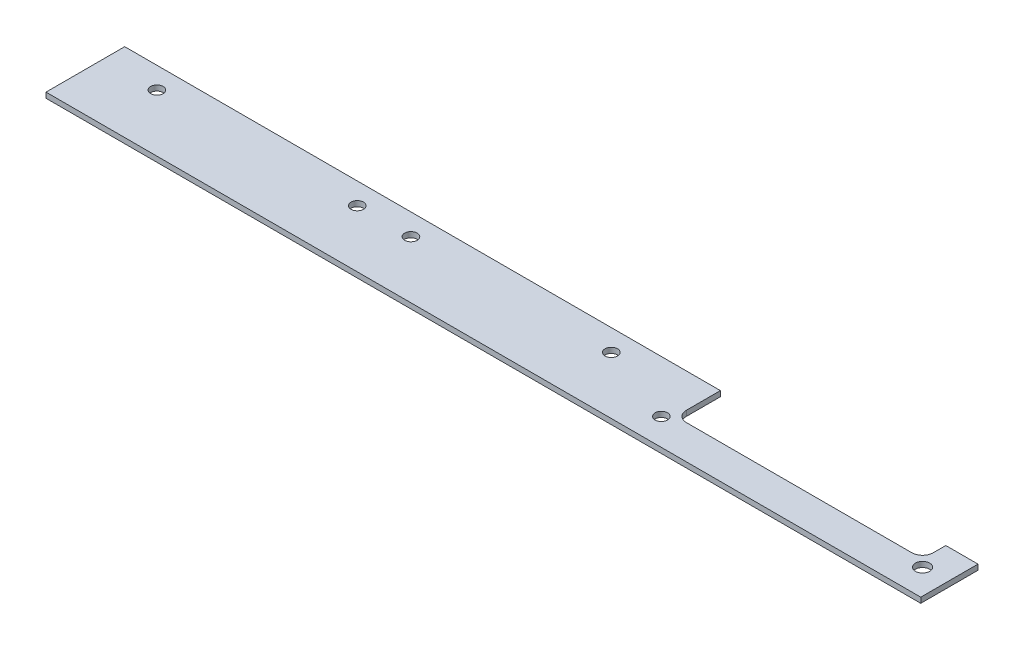
ISO-10303-21;
HEADER;
FILE_DESCRIPTION(('STEP AP214'),'2;1');
FILE_NAME('part.step','',(''),(''),'','','');
FILE_SCHEMA(('AUTOMOTIVE_DESIGN { 1 0 10303 214 1 1 1 1 }'));
ENDSEC;
DATA;
#1=APPLICATION_CONTEXT('core data for automotive mechanical design processes');
#2=APPLICATION_PROTOCOL_DEFINITION('international standard','automotive_design',2000,#1);
#3=PRODUCT_CONTEXT('',#1,'mechanical');
#4=PRODUCT('Part','Part','',(#3));
#5=PRODUCT_RELATED_PRODUCT_CATEGORY('part','',(#4));
#6=PRODUCT_DEFINITION_FORMATION('','',#4);
#7=PRODUCT_DEFINITION_CONTEXT('part definition',#1,'design');
#8=PRODUCT_DEFINITION('design','',#6,#7);
#9=PRODUCT_DEFINITION_SHAPE('','',#8);
#10=(LENGTH_UNIT() NAMED_UNIT(*) SI_UNIT(.MILLI.,.METRE.));
#11=(NAMED_UNIT(*) PLANE_ANGLE_UNIT() SI_UNIT($,.RADIAN.));
#12=(NAMED_UNIT(*) SI_UNIT($,.STERADIAN.) SOLID_ANGLE_UNIT());
#13=UNCERTAINTY_MEASURE_WITH_UNIT(LENGTH_MEASURE(1.E-05),#10,'distance_accuracy_value','');
#14=(GEOMETRIC_REPRESENTATION_CONTEXT(3) GLOBAL_UNCERTAINTY_ASSIGNED_CONTEXT((#13)) GLOBAL_UNIT_ASSIGNED_CONTEXT((#10,
#11,#12)) REPRESENTATION_CONTEXT('',''));
#15=CARTESIAN_POINT('',(0.,0.,0.));
#16=DIRECTION('',(0.,0.,1.));
#17=DIRECTION('',(1.,0.,0.));
#18=AXIS2_PLACEMENT_3D('',#15,#16,#17);
#19=CARTESIAN_POINT('',(169.5,1.5,-12.5));
#20=DIRECTION('',(0.,1.,0.));
#21=DIRECTION('',(0.,0.,1.));
#22=AXIS2_PLACEMENT_3D('',#19,#20,#21);
#23=PLANE('',#22);
#24=CARTESIAN_POINT('',(142.,1.5,-16.));
#25=DIRECTION('',(0.,1.,0.));
#26=DIRECTION('',(0.,0.,1.));
#27=AXIS2_PLACEMENT_3D('',#24,#25,#26);
#28=CIRCLE('',#27,1.74999999999998);
#29=CARTESIAN_POINT('',(142.,1.5,-14.25));
#30=VERTEX_POINT('',#29);
#31=EDGE_CURVE('E232',#30,#30,#28,.T.);
#32=ORIENTED_EDGE('',*,*,#31,.F.);
#33=EDGE_LOOP('',(#32));
#34=FACE_BOUND('',#33,.T.);
#35=CARTESIAN_POINT('',(164.5,1.5,-7.5));
#36=DIRECTION('',(0.,1.,0.));
#37=DIRECTION('',(0.,0.,1.));
#38=AXIS2_PLACEMENT_3D('',#35,#36,#37);
#39=CIRCLE('',#38,1.75000000000001);
#40=CARTESIAN_POINT('',(164.5,1.5,-5.74999999999999));
#41=VERTEX_POINT('',#40);
#42=EDGE_CURVE('E220',#41,#41,#39,.T.);
#43=ORIENTED_EDGE('',*,*,#42,.F.);
#44=EDGE_LOOP('',(#43));
#45=FACE_BOUND('',#44,.T.);
#46=CARTESIAN_POINT('',(15.,1.5,-16.));
#47=DIRECTION('',(0.,1.,0.));
#48=DIRECTION('',(0.,0.,1.));
#49=AXIS2_PLACEMENT_3D('',#46,#47,#48);
#50=CIRCLE('',#49,1.75);
#51=CARTESIAN_POINT('',(15.,1.5,-14.25));
#52=VERTEX_POINT('',#51);
#53=EDGE_CURVE('E148',#52,#52,#50,.T.);
#54=ORIENTED_EDGE('',*,*,#53,.F.);
#55=EDGE_LOOP('',(#54));
#56=FACE_BOUND('',#55,.T.);
#57=DIRECTION('',(0.,0.,1.));
#58=VECTOR('',#57,1.);
#59=CARTESIAN_POINT('',(0.,1.5,0.));
#60=LINE('',#59,#58);
#61=CARTESIAN_POINT('',(0.,1.5,-22.));
#62=VERTEX_POINT('',#61);
#63=CARTESIAN_POINT('',(0.,1.5,0.));
#64=VERTEX_POINT('',#63);
#65=EDGE_CURVE('E163',#62,#64,#60,.T.);
#66=ORIENTED_EDGE('',*,*,#65,.T.);
#67=DIRECTION('',(1.,0.,0.));
#68=VECTOR('',#67,1.);
#69=CARTESIAN_POINT('',(0.,1.5,0.));
#70=LINE('',#69,#68);
#71=CARTESIAN_POINT('',(244.5,1.5,0.));
#72=VERTEX_POINT('',#71);
#73=EDGE_CURVE('E101',#64,#72,#70,.T.);
#74=ORIENTED_EDGE('',*,*,#73,.T.);
#75=DIRECTION('',(0.,0.,-1.));
#76=VECTOR('',#75,1.);
#77=CARTESIAN_POINT('',(244.5,1.5,-16.));
#78=LINE('',#77,#76);
#79=CARTESIAN_POINT('',(244.5,1.5,-16.));
#80=VERTEX_POINT('',#79);
#81=EDGE_CURVE('E184',#72,#80,#78,.T.);
#82=ORIENTED_EDGE('',*,*,#81,.T.);
#83=DIRECTION('',(-1.,0.,0.));
#84=VECTOR('',#83,1.);
#85=CARTESIAN_POINT('',(235.5,1.5,-16.));
#86=LINE('',#85,#84);
#87=CARTESIAN_POINT('',(235.5,1.5,-16.));
#88=VERTEX_POINT('',#87);
#89=EDGE_CURVE('E203',#80,#88,#86,.T.);
#90=ORIENTED_EDGE('',*,*,#89,.T.);
#91=DIRECTION('',(0.,0.,1.));
#92=VECTOR('',#91,1.);
#93=CARTESIAN_POINT('',(235.5,1.5,-12.5));
#94=LINE('',#93,#92);
#95=CARTESIAN_POINT('',(235.5,1.5,-12.5));
#96=VERTEX_POINT('',#95);
#97=EDGE_CURVE('E200',#88,#96,#94,.T.);
#98=ORIENTED_EDGE('',*,*,#97,.T.);
#99=CARTESIAN_POINT('',(232.5,1.5,-12.5));
#100=DIRECTION('',(0.,-1.,0.));
#101=DIRECTION('',(0.,0.,1.));
#102=AXIS2_PLACEMENT_3D('',#99,#100,#101);
#103=CIRCLE('',#102,3.);
#104=CARTESIAN_POINT('',(232.5,1.5,-9.5));
#105=VERTEX_POINT('',#104);
#106=EDGE_CURVE('E202',#96,#105,#103,.T.);
#107=ORIENTED_EDGE('',*,*,#106,.T.);
#108=DIRECTION('',(-1.,0.,0.));
#109=VECTOR('',#108,1.);
#110=CARTESIAN_POINT('',(169.5,1.5,-9.5));
#111=LINE('',#110,#109);
#112=CARTESIAN_POINT('',(169.5,1.5,-9.5));
#113=VERTEX_POINT('',#112);
#114=EDGE_CURVE('E126',#105,#113,#111,.T.);
#115=ORIENTED_EDGE('',*,*,#114,.T.);
#116=CARTESIAN_POINT('',(169.5,1.5,-12.5));
#117=DIRECTION('',(0.,-1.,0.));
#118=DIRECTION('',(0.,0.,1.));
#119=AXIS2_PLACEMENT_3D('',#116,#117,#118);
#120=CIRCLE('',#119,3.);
#121=CARTESIAN_POINT('',(166.5,1.5,-12.5));
#122=VERTEX_POINT('',#121);
#123=EDGE_CURVE('E120',#113,#122,#120,.T.);
#124=ORIENTED_EDGE('',*,*,#123,.T.);
#125=DIRECTION('',(0.,0.,-1.));
#126=VECTOR('',#125,1.);
#127=CARTESIAN_POINT('',(166.5,1.5,-22.));
#128=LINE('',#127,#126);
#129=CARTESIAN_POINT('',(166.5,1.5,-22.));
#130=VERTEX_POINT('',#129);
#131=EDGE_CURVE('E124',#122,#130,#128,.T.);
#132=ORIENTED_EDGE('',*,*,#131,.T.);
#133=DIRECTION('',(-1.,0.,0.));
#134=VECTOR('',#133,1.);
#135=CARTESIAN_POINT('',(0.,1.5,-22.));
#136=LINE('',#135,#134);
#137=EDGE_CURVE('E52',#130,#62,#136,.T.);
#138=ORIENTED_EDGE('',*,*,#137,.T.);
#139=EDGE_LOOP('',(#66,#74,#82,#90,#98,#107,#115,#124,#132,#138));
#140=FACE_BOUND('',#139,.T.);
#141=CARTESIAN_POINT('',(71.,1.5,-16.));
#142=DIRECTION('',(0.,1.,0.));
#143=DIRECTION('',(0.,0.,1.));
#144=AXIS2_PLACEMENT_3D('',#141,#142,#143);
#145=CIRCLE('',#144,1.75);
#146=CARTESIAN_POINT('',(71.,1.5,-14.25));
#147=VERTEX_POINT('',#146);
#148=EDGE_CURVE('E214',#147,#147,#145,.T.);
#149=ORIENTED_EDGE('',*,*,#148,.F.);
#150=EDGE_LOOP('',(#149));
#151=FACE_BOUND('',#150,.T.);
#152=CARTESIAN_POINT('',(86.,1.5,-16.));
#153=DIRECTION('',(0.,1.,0.));
#154=DIRECTION('',(0.,0.,1.));
#155=AXIS2_PLACEMENT_3D('',#152,#153,#154);
#156=CIRCLE('',#155,1.75);
#157=CARTESIAN_POINT('',(86.,1.5,-14.25));
#158=VERTEX_POINT('',#157);
#159=EDGE_CURVE('E226',#158,#158,#156,.T.);
#160=ORIENTED_EDGE('',*,*,#159,.F.);
#161=EDGE_LOOP('',(#160));
#162=FACE_BOUND('',#161,.T.);
#163=CARTESIAN_POINT('',(237.5,1.5,-7.5));
#164=DIRECTION('',(0.,1.,0.));
#165=DIRECTION('',(0.,0.,1.));
#166=AXIS2_PLACEMENT_3D('',#163,#164,#165);
#167=CIRCLE('',#166,2.);
#168=CARTESIAN_POINT('',(237.5,1.5,-5.5));
#169=VERTEX_POINT('',#168);
#170=EDGE_CURVE('E238',#169,#169,#167,.T.);
#171=ORIENTED_EDGE('',*,*,#170,.F.);
#172=EDGE_LOOP('',(#171));
#173=FACE_BOUND('',#172,.T.);
#174=ADVANCED_FACE('F35',(#34,#45,#56,#140,#151,#162,#173),#23,.T.);
#175=CARTESIAN_POINT('',(169.5,0.,-12.5));
#176=DIRECTION('',(0.,1.,0.));
#177=DIRECTION('',(0.,0.,1.));
#178=AXIS2_PLACEMENT_3D('',#175,#176,#177);
#179=PLANE('',#178);
#180=DIRECTION('',(0.,0.,1.));
#181=VECTOR('',#180,1.);
#182=CARTESIAN_POINT('',(0.,0.,0.));
#183=LINE('',#182,#181);
#184=CARTESIAN_POINT('',(0.,0.,-22.));
#185=VERTEX_POINT('',#184);
#186=CARTESIAN_POINT('',(0.,0.,0.));
#187=VERTEX_POINT('',#186);
#188=EDGE_CURVE('E144',#185,#187,#183,.T.);
#189=ORIENTED_EDGE('',*,*,#188,.F.);
#190=DIRECTION('',(-1.,0.,0.));
#191=VECTOR('',#190,1.);
#192=CARTESIAN_POINT('',(0.,0.,-22.));
#193=LINE('',#192,#191);
#194=CARTESIAN_POINT('',(166.5,0.,-22.));
#195=VERTEX_POINT('',#194);
#196=EDGE_CURVE('E93',#195,#185,#193,.T.);
#197=ORIENTED_EDGE('',*,*,#196,.F.);
#198=DIRECTION('',(0.,0.,-1.));
#199=VECTOR('',#198,1.);
#200=CARTESIAN_POINT('',(166.5,0.,-22.));
#201=LINE('',#200,#199);
#202=CARTESIAN_POINT('',(166.5,0.,-12.5));
#203=VERTEX_POINT('',#202);
#204=EDGE_CURVE('E87',#203,#195,#201,.T.);
#205=ORIENTED_EDGE('',*,*,#204,.F.);
#206=CARTESIAN_POINT('',(169.5,0.,-12.5));
#207=DIRECTION('',(0.,-1.,0.));
#208=DIRECTION('',(0.,0.,1.));
#209=AXIS2_PLACEMENT_3D('',#206,#207,#208);
#210=CIRCLE('',#209,3.);
#211=CARTESIAN_POINT('',(169.5,0.,-9.5));
#212=VERTEX_POINT('',#211);
#213=EDGE_CURVE('E134',#212,#203,#210,.T.);
#214=ORIENTED_EDGE('',*,*,#213,.F.);
#215=DIRECTION('',(-1.,0.,0.));
#216=VECTOR('',#215,1.);
#217=CARTESIAN_POINT('',(169.5,0.,-9.5));
#218=LINE('',#217,#216);
#219=CARTESIAN_POINT('',(232.5,0.,-9.5));
#220=VERTEX_POINT('',#219);
#221=EDGE_CURVE('E158',#220,#212,#218,.T.);
#222=ORIENTED_EDGE('',*,*,#221,.F.);
#223=CARTESIAN_POINT('',(232.5,0.,-12.5));
#224=DIRECTION('',(0.,-1.,0.));
#225=DIRECTION('',(0.,0.,1.));
#226=AXIS2_PLACEMENT_3D('',#223,#224,#225);
#227=CIRCLE('',#226,3.);
#228=CARTESIAN_POINT('',(235.5,0.,-12.5));
#229=VERTEX_POINT('',#228);
#230=EDGE_CURVE('E156',#229,#220,#227,.T.);
#231=ORIENTED_EDGE('',*,*,#230,.F.);
#232=DIRECTION('',(0.,0.,1.));
#233=VECTOR('',#232,1.);
#234=CARTESIAN_POINT('',(235.5,0.,-12.5));
#235=LINE('',#234,#233);
#236=CARTESIAN_POINT('',(235.5,0.,-16.));
#237=VERTEX_POINT('',#236);
#238=EDGE_CURVE('E154',#237,#229,#235,.T.);
#239=ORIENTED_EDGE('',*,*,#238,.F.);
#240=DIRECTION('',(-1.,0.,0.));
#241=VECTOR('',#240,1.);
#242=CARTESIAN_POINT('',(235.5,0.,-16.));
#243=LINE('',#242,#241);
#244=CARTESIAN_POINT('',(244.5,0.,-16.));
#245=VERTEX_POINT('',#244);
#246=EDGE_CURVE('E152',#245,#237,#243,.T.);
#247=ORIENTED_EDGE('',*,*,#246,.F.);
#248=DIRECTION('',(0.,0.,-1.));
#249=VECTOR('',#248,1.);
#250=CARTESIAN_POINT('',(244.5,0.,-16.));
#251=LINE('',#250,#249);
#252=CARTESIAN_POINT('',(244.5,0.,0.));
#253=VERTEX_POINT('',#252);
#254=EDGE_CURVE('E150',#253,#245,#251,.T.);
#255=ORIENTED_EDGE('',*,*,#254,.F.);
#256=DIRECTION('',(1.,0.,0.));
#257=VECTOR('',#256,1.);
#258=CARTESIAN_POINT('',(0.,0.,0.));
#259=LINE('',#258,#257);
#260=EDGE_CURVE('E147',#187,#253,#259,.T.);
#261=ORIENTED_EDGE('',*,*,#260,.F.);
#262=EDGE_LOOP('',(#189,#197,#205,#214,#222,#231,#239,#247,#255,#261));
#263=FACE_BOUND('',#262,.T.);
#264=CARTESIAN_POINT('',(15.,0.,-16.));
#265=DIRECTION('',(0.,1.,0.));
#266=DIRECTION('',(0.,0.,1.));
#267=AXIS2_PLACEMENT_3D('',#264,#265,#266);
#268=CIRCLE('',#267,1.75);
#269=CARTESIAN_POINT('',(15.,0.,-14.25));
#270=VERTEX_POINT('',#269);
#271=EDGE_CURVE('E211',#270,#270,#268,.T.);
#272=ORIENTED_EDGE('',*,*,#271,.T.);
#273=EDGE_LOOP('',(#272));
#274=FACE_BOUND('',#273,.T.);
#275=CARTESIAN_POINT('',(71.,0.,-16.));
#276=DIRECTION('',(0.,1.,0.));
#277=DIRECTION('',(0.,0.,1.));
#278=AXIS2_PLACEMENT_3D('',#275,#276,#277);
#279=CIRCLE('',#278,1.75);
#280=CARTESIAN_POINT('',(71.,0.,-14.25));
#281=VERTEX_POINT('',#280);
#282=EDGE_CURVE('E217',#281,#281,#279,.T.);
#283=ORIENTED_EDGE('',*,*,#282,.T.);
#284=EDGE_LOOP('',(#283));
#285=FACE_BOUND('',#284,.T.);
#286=CARTESIAN_POINT('',(164.5,0.,-7.5));
#287=DIRECTION('',(0.,1.,0.));
#288=DIRECTION('',(0.,0.,1.));
#289=AXIS2_PLACEMENT_3D('',#286,#287,#288);
#290=CIRCLE('',#289,1.75000000000001);
#291=CARTESIAN_POINT('',(164.5,0.,-5.74999999999999));
#292=VERTEX_POINT('',#291);
#293=EDGE_CURVE('E223',#292,#292,#290,.T.);
#294=ORIENTED_EDGE('',*,*,#293,.T.);
#295=EDGE_LOOP('',(#294));
#296=FACE_BOUND('',#295,.T.);
#297=CARTESIAN_POINT('',(86.,0.,-16.));
#298=DIRECTION('',(0.,1.,0.));
#299=DIRECTION('',(0.,0.,1.));
#300=AXIS2_PLACEMENT_3D('',#297,#298,#299);
#301=CIRCLE('',#300,1.75);
#302=CARTESIAN_POINT('',(86.,0.,-14.25));
#303=VERTEX_POINT('',#302);
#304=EDGE_CURVE('E229',#303,#303,#301,.T.);
#305=ORIENTED_EDGE('',*,*,#304,.T.);
#306=EDGE_LOOP('',(#305));
#307=FACE_BOUND('',#306,.T.);
#308=CARTESIAN_POINT('',(142.,0.,-16.));
#309=DIRECTION('',(0.,1.,0.));
#310=DIRECTION('',(0.,0.,1.));
#311=AXIS2_PLACEMENT_3D('',#308,#309,#310);
#312=CIRCLE('',#311,1.74999999999998);
#313=CARTESIAN_POINT('',(142.,0.,-14.25));
#314=VERTEX_POINT('',#313);
#315=EDGE_CURVE('E235',#314,#314,#312,.T.);
#316=ORIENTED_EDGE('',*,*,#315,.T.);
#317=EDGE_LOOP('',(#316));
#318=FACE_BOUND('',#317,.T.);
#319=CARTESIAN_POINT('',(237.5,0.,-7.5));
#320=DIRECTION('',(0.,1.,0.));
#321=DIRECTION('',(0.,0.,1.));
#322=AXIS2_PLACEMENT_3D('',#319,#320,#321);
#323=CIRCLE('',#322,2.);
#324=CARTESIAN_POINT('',(237.5,0.,-5.5));
#325=VERTEX_POINT('',#324);
#326=EDGE_CURVE('E241',#325,#325,#323,.T.);
#327=ORIENTED_EDGE('',*,*,#326,.T.);
#328=EDGE_LOOP('',(#327));
#329=FACE_BOUND('',#328,.T.);
#330=ADVANCED_FACE('F188',(#263,#274,#285,#296,#307,#318,#329),#179,.F.);
#331=CARTESIAN_POINT('',(0.,1.5,0.));
#332=DIRECTION('',(1.,0.,0.));
#333=DIRECTION('',(0.,0.,-1.));
#334=AXIS2_PLACEMENT_3D('',#331,#332,#333);
#335=PLANE('',#334);
#336=ORIENTED_EDGE('',*,*,#188,.T.);
#337=DIRECTION('',(0.,-1.,0.));
#338=VECTOR('',#337,1.);
#339=CARTESIAN_POINT('',(0.,1.5,0.));
#340=LINE('',#339,#338);
#341=EDGE_CURVE('E11',#64,#187,#340,.T.);
#342=ORIENTED_EDGE('',*,*,#341,.F.);
#343=ORIENTED_EDGE('',*,*,#65,.F.);
#344=DIRECTION('',(0.,-1.,0.));
#345=VECTOR('',#344,1.);
#346=CARTESIAN_POINT('',(0.,1.5,-22.));
#347=LINE('',#346,#345);
#348=EDGE_CURVE('E140',#62,#185,#347,.T.);
#349=ORIENTED_EDGE('',*,*,#348,.T.);
#350=EDGE_LOOP('',(#336,#342,#343,#349));
#351=FACE_BOUND('',#350,.T.);
#352=ADVANCED_FACE('F37',(#351),#335,.F.);
#353=CARTESIAN_POINT('',(0.,1.5,0.));
#354=DIRECTION('',(0.,0.,-1.));
#355=DIRECTION('',(-1.,0.,0.));
#356=AXIS2_PLACEMENT_3D('',#353,#354,#355);
#357=PLANE('',#356);
#358=ORIENTED_EDGE('',*,*,#260,.T.);
#359=DIRECTION('',(0.,-1.,0.));
#360=VECTOR('',#359,1.);
#361=CARTESIAN_POINT('',(244.5,1.5,0.));
#362=LINE('',#361,#360);
#363=EDGE_CURVE('E44',#72,#253,#362,.T.);
#364=ORIENTED_EDGE('',*,*,#363,.F.);
#365=ORIENTED_EDGE('',*,*,#73,.F.);
#366=ORIENTED_EDGE('',*,*,#341,.T.);
#367=EDGE_LOOP('',(#358,#364,#365,#366));
#368=FACE_BOUND('',#367,.T.);
#369=ADVANCED_FACE('F283',(#368),#357,.F.);
#370=CARTESIAN_POINT('',(244.5,1.5,-16.));
#371=DIRECTION('',(-1.,0.,0.));
#372=DIRECTION('',(0.,0.,1.));
#373=AXIS2_PLACEMENT_3D('',#370,#371,#372);
#374=PLANE('',#373);
#375=ORIENTED_EDGE('',*,*,#254,.T.);
#376=DIRECTION('',(0.,-1.,0.));
#377=VECTOR('',#376,1.);
#378=CARTESIAN_POINT('',(244.5,1.5,-16.));
#379=LINE('',#378,#377);
#380=EDGE_CURVE('E176',#80,#245,#379,.T.);
#381=ORIENTED_EDGE('',*,*,#380,.F.);
#382=ORIENTED_EDGE('',*,*,#81,.F.);
#383=ORIENTED_EDGE('',*,*,#363,.T.);
#384=EDGE_LOOP('',(#375,#381,#382,#383));
#385=FACE_BOUND('',#384,.T.);
#386=ADVANCED_FACE('F182',(#385),#374,.F.);
#387=CARTESIAN_POINT('',(235.5,1.5,-16.));
#388=DIRECTION('',(0.,0.,1.));
#389=DIRECTION('',(1.,0.,0.));
#390=AXIS2_PLACEMENT_3D('',#387,#388,#389);
#391=PLANE('',#390);
#392=ORIENTED_EDGE('',*,*,#246,.T.);
#393=DIRECTION('',(0.,-1.,0.));
#394=VECTOR('',#393,1.);
#395=CARTESIAN_POINT('',(235.5,1.5,-16.));
#396=LINE('',#395,#394);
#397=EDGE_CURVE('E173',#88,#237,#396,.T.);
#398=ORIENTED_EDGE('',*,*,#397,.F.);
#399=ORIENTED_EDGE('',*,*,#89,.F.);
#400=ORIENTED_EDGE('',*,*,#380,.T.);
#401=EDGE_LOOP('',(#392,#398,#399,#400));
#402=FACE_BOUND('',#401,.T.);
#403=ADVANCED_FACE('F194',(#402),#391,.F.);
#404=CARTESIAN_POINT('',(235.5,1.5,-12.5));
#405=DIRECTION('',(1.,0.,0.));
#406=DIRECTION('',(0.,0.,-1.));
#407=AXIS2_PLACEMENT_3D('',#404,#405,#406);
#408=PLANE('',#407);
#409=ORIENTED_EDGE('',*,*,#238,.T.);
#410=DIRECTION('',(0.,-1.,0.));
#411=VECTOR('',#410,1.);
#412=CARTESIAN_POINT('',(235.5,1.5,-12.5));
#413=LINE('',#412,#411);
#414=EDGE_CURVE('E170',#96,#229,#413,.T.);
#415=ORIENTED_EDGE('',*,*,#414,.F.);
#416=ORIENTED_EDGE('',*,*,#97,.F.);
#417=ORIENTED_EDGE('',*,*,#397,.T.);
#418=EDGE_LOOP('',(#409,#415,#416,#417));
#419=FACE_BOUND('',#418,.T.);
#420=ADVANCED_FACE('F198',(#419),#408,.F.);
#421=CARTESIAN_POINT('',(232.5,1.5,-12.5));
#422=DIRECTION('',(0.,-1.,0.));
#423=DIRECTION('',(0.,0.,-1.));
#424=AXIS2_PLACEMENT_3D('',#421,#422,#423);
#425=CYLINDRICAL_SURFACE('',#424,3.);
#426=ORIENTED_EDGE('',*,*,#230,.T.);
#427=DIRECTION('',(0.,-1.,0.));
#428=VECTOR('',#427,1.);
#429=CARTESIAN_POINT('',(232.5,1.5,-9.5));
#430=LINE('',#429,#428);
#431=EDGE_CURVE('E167',#105,#220,#430,.T.);
#432=ORIENTED_EDGE('',*,*,#431,.F.);
#433=ORIENTED_EDGE('',*,*,#106,.F.);
#434=ORIENTED_EDGE('',*,*,#414,.T.);
#435=EDGE_LOOP('',(#426,#432,#433,#434));
#436=FACE_BOUND('',#435,.T.);
#437=ADVANCED_FACE('F273',(#436),#425,.F.);
#438=CARTESIAN_POINT('',(169.5,1.5,-9.5));
#439=DIRECTION('',(0.,0.,1.));
#440=DIRECTION('',(1.,0.,0.));
#441=AXIS2_PLACEMENT_3D('',#438,#439,#440);
#442=PLANE('',#441);
#443=ORIENTED_EDGE('',*,*,#221,.T.);
#444=DIRECTION('',(0.,-1.,0.));
#445=VECTOR('',#444,1.);
#446=CARTESIAN_POINT('',(169.5,1.5,-9.5));
#447=LINE('',#446,#445);
#448=EDGE_CURVE('E135',#113,#212,#447,.T.);
#449=ORIENTED_EDGE('',*,*,#448,.F.);
#450=ORIENTED_EDGE('',*,*,#114,.F.);
#451=ORIENTED_EDGE('',*,*,#431,.T.);
#452=EDGE_LOOP('',(#443,#449,#450,#451));
#453=FACE_BOUND('',#452,.T.);
#454=ADVANCED_FACE('F270',(#453),#442,.F.);
#455=CARTESIAN_POINT('',(169.5,1.5,-12.5));
#456=DIRECTION('',(0.,-1.,0.));
#457=DIRECTION('',(0.,0.,-1.));
#458=AXIS2_PLACEMENT_3D('',#455,#456,#457);
#459=CYLINDRICAL_SURFACE('',#458,3.);
#460=ORIENTED_EDGE('',*,*,#213,.T.);
#461=DIRECTION('',(0.,-1.,0.));
#462=VECTOR('',#461,1.);
#463=CARTESIAN_POINT('',(166.5,1.5,-12.5));
#464=LINE('',#463,#462);
#465=EDGE_CURVE('E131',#122,#203,#464,.T.);
#466=ORIENTED_EDGE('',*,*,#465,.F.);
#467=ORIENTED_EDGE('',*,*,#123,.F.);
#468=ORIENTED_EDGE('',*,*,#448,.T.);
#469=EDGE_LOOP('',(#460,#466,#467,#468));
#470=FACE_BOUND('',#469,.T.);
#471=ADVANCED_FACE('F132',(#470),#459,.F.);
#472=CARTESIAN_POINT('',(166.5,1.5,-22.));
#473=DIRECTION('',(-1.,0.,0.));
#474=DIRECTION('',(0.,0.,1.));
#475=AXIS2_PLACEMENT_3D('',#472,#473,#474);
#476=PLANE('',#475);
#477=ORIENTED_EDGE('',*,*,#204,.T.);
#478=DIRECTION('',(0.,-1.,0.));
#479=VECTOR('',#478,1.);
#480=CARTESIAN_POINT('',(166.5,1.5,-22.));
#481=LINE('',#480,#479);
#482=EDGE_CURVE('E136',#130,#195,#481,.T.);
#483=ORIENTED_EDGE('',*,*,#482,.F.);
#484=ORIENTED_EDGE('',*,*,#131,.F.);
#485=ORIENTED_EDGE('',*,*,#465,.T.);
#486=EDGE_LOOP('',(#477,#483,#484,#485));
#487=FACE_BOUND('',#486,.T.);
#488=ADVANCED_FACE('F138',(#487),#476,.F.);
#489=CARTESIAN_POINT('',(0.,1.5,-22.));
#490=DIRECTION('',(0.,0.,1.));
#491=DIRECTION('',(1.,0.,0.));
#492=AXIS2_PLACEMENT_3D('',#489,#490,#491);
#493=PLANE('',#492);
#494=ORIENTED_EDGE('',*,*,#196,.T.);
#495=ORIENTED_EDGE('',*,*,#348,.F.);
#496=ORIENTED_EDGE('',*,*,#137,.F.);
#497=ORIENTED_EDGE('',*,*,#482,.T.);
#498=EDGE_LOOP('',(#494,#495,#496,#497));
#499=FACE_BOUND('',#498,.T.);
#500=ADVANCED_FACE('F263',(#499),#493,.F.);
#501=CARTESIAN_POINT('',(15.,1.5,-16.));
#502=DIRECTION('',(0.,-1.,0.));
#503=DIRECTION('',(0.,0.,-1.));
#504=AXIS2_PLACEMENT_3D('',#501,#502,#503);
#505=CYLINDRICAL_SURFACE('',#504,1.75);
#506=ORIENTED_EDGE('',*,*,#53,.T.);
#507=EDGE_LOOP('',(#506));
#508=FACE_BOUND('',#507,.T.);
#509=ORIENTED_EDGE('',*,*,#271,.F.);
#510=EDGE_LOOP('',(#509));
#511=FACE_BOUND('',#510,.T.);
#512=ADVANCED_FACE('F260',(#508,#511),#505,.F.);
#513=CARTESIAN_POINT('',(71.,1.5,-16.));
#514=DIRECTION('',(0.,-1.,0.));
#515=DIRECTION('',(0.,0.,-1.));
#516=AXIS2_PLACEMENT_3D('',#513,#514,#515);
#517=CYLINDRICAL_SURFACE('',#516,1.75);
#518=ORIENTED_EDGE('',*,*,#148,.T.);
#519=EDGE_LOOP('',(#518));
#520=FACE_BOUND('',#519,.T.);
#521=ORIENTED_EDGE('',*,*,#282,.F.);
#522=EDGE_LOOP('',(#521));
#523=FACE_BOUND('',#522,.T.);
#524=ADVANCED_FACE('F359',(#520,#523),#517,.F.);
#525=CARTESIAN_POINT('',(164.5,1.5,-7.5));
#526=DIRECTION('',(0.,-1.,0.));
#527=DIRECTION('',(0.,0.,-1.));
#528=AXIS2_PLACEMENT_3D('',#525,#526,#527);
#529=CYLINDRICAL_SURFACE('',#528,1.75000000000001);
#530=ORIENTED_EDGE('',*,*,#42,.T.);
#531=EDGE_LOOP('',(#530));
#532=FACE_BOUND('',#531,.T.);
#533=ORIENTED_EDGE('',*,*,#293,.F.);
#534=EDGE_LOOP('',(#533));
#535=FACE_BOUND('',#534,.T.);
#536=ADVANCED_FACE('F367',(#532,#535),#529,.F.);
#537=CARTESIAN_POINT('',(86.,1.5,-16.));
#538=DIRECTION('',(0.,-1.,0.));
#539=DIRECTION('',(0.,0.,-1.));
#540=AXIS2_PLACEMENT_3D('',#537,#538,#539);
#541=CYLINDRICAL_SURFACE('',#540,1.75);
#542=ORIENTED_EDGE('',*,*,#159,.T.);
#543=EDGE_LOOP('',(#542));
#544=FACE_BOUND('',#543,.T.);
#545=ORIENTED_EDGE('',*,*,#304,.F.);
#546=EDGE_LOOP('',(#545));
#547=FACE_BOUND('',#546,.T.);
#548=ADVANCED_FACE('F375',(#544,#547),#541,.F.);
#549=CARTESIAN_POINT('',(142.,1.5,-16.));
#550=DIRECTION('',(0.,-1.,0.));
#551=DIRECTION('',(0.,0.,-1.));
#552=AXIS2_PLACEMENT_3D('',#549,#550,#551);
#553=CYLINDRICAL_SURFACE('',#552,1.74999999999998);
#554=ORIENTED_EDGE('',*,*,#31,.T.);
#555=EDGE_LOOP('',(#554));
#556=FACE_BOUND('',#555,.T.);
#557=ORIENTED_EDGE('',*,*,#315,.F.);
#558=EDGE_LOOP('',(#557));
#559=FACE_BOUND('',#558,.T.);
#560=ADVANCED_FACE('F384',(#556,#559),#553,.F.);
#561=CARTESIAN_POINT('',(237.5,1.5,-7.5));
#562=DIRECTION('',(0.,-1.,0.));
#563=DIRECTION('',(0.,0.,-1.));
#564=AXIS2_PLACEMENT_3D('',#561,#562,#563);
#565=CYLINDRICAL_SURFACE('',#564,2.);
#566=ORIENTED_EDGE('',*,*,#170,.T.);
#567=EDGE_LOOP('',(#566));
#568=FACE_BOUND('',#567,.T.);
#569=ORIENTED_EDGE('',*,*,#326,.F.);
#570=EDGE_LOOP('',(#569));
#571=FACE_BOUND('',#570,.T.);
#572=ADVANCED_FACE('F247',(#568,#571),#565,.F.);
#573=CLOSED_SHELL('',(#174,#330,#352,#369,#386,#403,#420,#437,#454,#471,#488,#500,#512,#524,
#536,#548,#560,#572));
#574=MANIFOLD_SOLID_BREP('B2',#573);
#575=ADVANCED_BREP_SHAPE_REPRESENTATION('',(#18,#574),#14);
#576=SHAPE_DEFINITION_REPRESENTATION(#9,#575);
ENDSEC;
END-ISO-10303-21;
